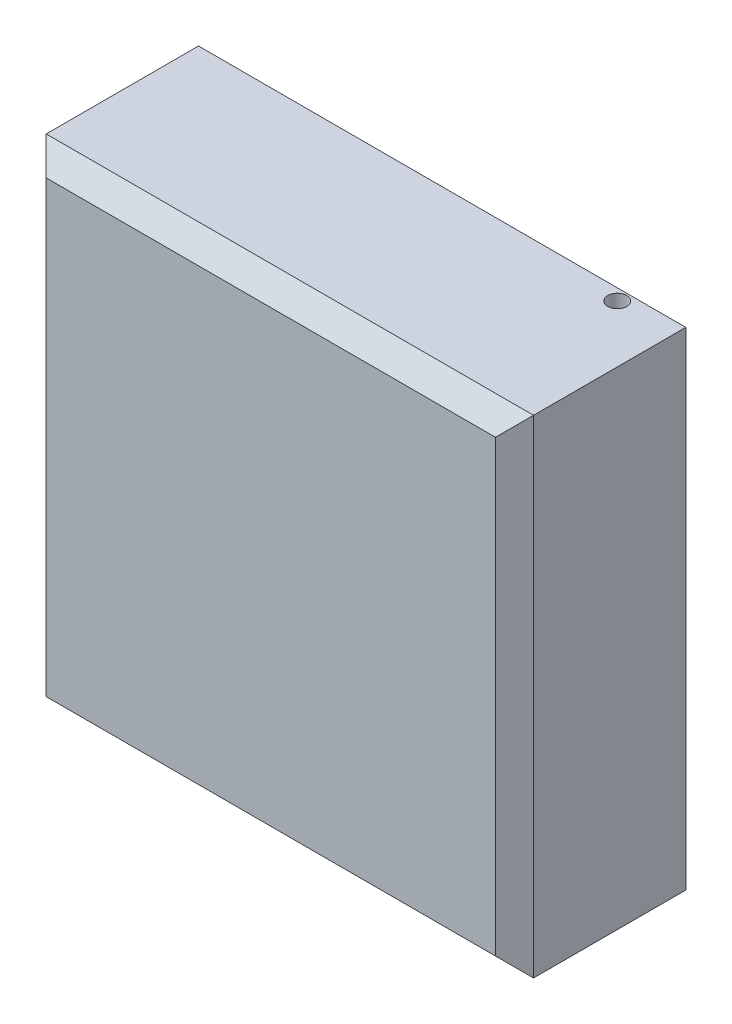
ISO-10303-21;
HEADER;
FILE_DESCRIPTION(('STEP AP214'),'2;1');
FILE_NAME('part.step','',(''),(''),'','','');
FILE_SCHEMA(('AUTOMOTIVE_DESIGN { 1 0 10303 214 1 1 1 1 }'));
ENDSEC;
DATA;
#1=APPLICATION_CONTEXT('core data for automotive mechanical design processes');
#2=APPLICATION_PROTOCOL_DEFINITION('international standard','automotive_design',2000,#1);
#3=PRODUCT_CONTEXT('',#1,'mechanical');
#4=PRODUCT('Part','Part','',(#3));
#5=PRODUCT_RELATED_PRODUCT_CATEGORY('part','',(#4));
#6=PRODUCT_DEFINITION_FORMATION('','',#4);
#7=PRODUCT_DEFINITION_CONTEXT('part definition',#1,'design');
#8=PRODUCT_DEFINITION('design','',#6,#7);
#9=PRODUCT_DEFINITION_SHAPE('','',#8);
#10=(LENGTH_UNIT() NAMED_UNIT(*) SI_UNIT(.MILLI.,.METRE.));
#11=(NAMED_UNIT(*) PLANE_ANGLE_UNIT() SI_UNIT($,.RADIAN.));
#12=(NAMED_UNIT(*) SI_UNIT($,.STERADIAN.) SOLID_ANGLE_UNIT());
#13=UNCERTAINTY_MEASURE_WITH_UNIT(LENGTH_MEASURE(1.E-05),#10,'distance_accuracy_value','');
#14=(GEOMETRIC_REPRESENTATION_CONTEXT(3) GLOBAL_UNCERTAINTY_ASSIGNED_CONTEXT((#13)) GLOBAL_UNIT_ASSIGNED_CONTEXT((#10,
#11,#12)) REPRESENTATION_CONTEXT('',''));
#15=CARTESIAN_POINT('',(0.,0.,0.));
#16=DIRECTION('',(0.,0.,1.));
#17=DIRECTION('',(1.,0.,0.));
#18=AXIS2_PLACEMENT_3D('',#15,#16,#17);
#19=CARTESIAN_POINT('',(128.,128.,100.));
#20=DIRECTION('',(-1.,0.,0.));
#21=DIRECTION('',(0.,-1.,0.));
#22=AXIS2_PLACEMENT_3D('',#19,#20,#21);
#23=PLANE('',#22);
#24=DIRECTION('',(0.,0.,-1.));
#25=VECTOR('',#24,1.);
#26=CARTESIAN_POINT('',(128.,-128.,100.));
#27=LINE('',#26,#25);
#28=CARTESIAN_POINT('',(128.,-128.,90.));
#29=VERTEX_POINT('',#28);
#30=CARTESIAN_POINT('',(128.,-128.,9.99999999999995));
#31=VERTEX_POINT('',#30);
#32=EDGE_CURVE('E179',#29,#31,#27,.T.);
#33=ORIENTED_EDGE('',*,*,#32,.T.);
#34=DIRECTION('',(0.,1.,0.));
#35=VECTOR('',#34,1.);
#36=CARTESIAN_POINT('',(128.,128.,9.99999999999995));
#37=LINE('',#36,#35);
#38=CARTESIAN_POINT('',(128.,128.,9.99999999999995));
#39=VERTEX_POINT('',#38);
#40=EDGE_CURVE('E112',#31,#39,#37,.T.);
#41=ORIENTED_EDGE('',*,*,#40,.T.);
#42=DIRECTION('',(0.,0.,-1.));
#43=VECTOR('',#42,1.);
#44=CARTESIAN_POINT('',(128.,128.,100.));
#45=LINE('',#44,#43);
#46=CARTESIAN_POINT('',(128.,128.,90.));
#47=VERTEX_POINT('',#46);
#48=EDGE_CURVE('E123',#47,#39,#45,.T.);
#49=ORIENTED_EDGE('',*,*,#48,.F.);
#50=DIRECTION('',(0.,-1.,0.));
#51=VECTOR('',#50,1.);
#52=CARTESIAN_POINT('',(128.,-128.,90.));
#53=LINE('',#52,#51);
#54=EDGE_CURVE('E144',#47,#29,#53,.T.);
#55=ORIENTED_EDGE('',*,*,#54,.T.);
#56=EDGE_LOOP('',(#33,#41,#49,#55));
#57=FACE_BOUND('',#56,.T.);
#58=ADVANCED_FACE('F33',(#57),#23,.F.);
#59=CARTESIAN_POINT('',(-128.,128.,100.));
#60=DIRECTION('',(0.,-1.,0.));
#61=DIRECTION('',(0.,0.,-1.));
#62=AXIS2_PLACEMENT_3D('',#59,#60,#61);
#63=PLANE('',#62);
#64=CARTESIAN_POINT('',(98.,128.,16.));
#65=DIRECTION('',(0.,-1.,0.));
#66=DIRECTION('',(0.,0.,-1.));
#67=AXIS2_PLACEMENT_3D('',#64,#65,#66);
#68=CIRCLE('',#67,5.);
#69=CARTESIAN_POINT('',(98.,128.,11.));
#70=VERTEX_POINT('',#69);
#71=EDGE_CURVE('E183',#70,#70,#68,.T.);
#72=ORIENTED_EDGE('',*,*,#71,.T.);
#73=EDGE_LOOP('',(#72));
#74=FACE_BOUND('',#73,.T.);
#75=ORIENTED_EDGE('',*,*,#48,.T.);
#76=DIRECTION('',(-1.,0.,0.));
#77=VECTOR('',#76,1.);
#78=CARTESIAN_POINT('',(-128.,128.,9.99999999999995));
#79=LINE('',#78,#77);
#80=CARTESIAN_POINT('',(-128.,128.,9.99999999999995));
#81=VERTEX_POINT('',#80);
#82=EDGE_CURVE('E122',#39,#81,#79,.T.);
#83=ORIENTED_EDGE('',*,*,#82,.T.);
#84=DIRECTION('',(0.,0.,-1.));
#85=VECTOR('',#84,1.);
#86=CARTESIAN_POINT('',(-128.,128.,100.));
#87=LINE('',#86,#85);
#88=CARTESIAN_POINT('',(-128.,128.,90.));
#89=VERTEX_POINT('',#88);
#90=EDGE_CURVE('E104',#89,#81,#87,.T.);
#91=ORIENTED_EDGE('',*,*,#90,.F.);
#92=DIRECTION('',(1.,0.,0.));
#93=VECTOR('',#92,1.);
#94=CARTESIAN_POINT('',(128.,128.,90.));
#95=LINE('',#94,#93);
#96=EDGE_CURVE('E119',#89,#47,#95,.T.);
#97=ORIENTED_EDGE('',*,*,#96,.T.);
#98=EDGE_LOOP('',(#75,#83,#91,#97));
#99=FACE_BOUND('',#98,.T.);
#100=ADVANCED_FACE('F117',(#74,#99),#63,.F.);
#101=CARTESIAN_POINT('',(-128.,128.,100.));
#102=DIRECTION('',(1.,0.,0.));
#103=DIRECTION('',(0.,1.,0.));
#104=AXIS2_PLACEMENT_3D('',#101,#102,#103);
#105=PLANE('',#104);
#106=ORIENTED_EDGE('',*,*,#90,.T.);
#107=DIRECTION('',(0.,-1.,0.));
#108=VECTOR('',#107,1.);
#109=CARTESIAN_POINT('',(-128.,128.,9.99999999999995));
#110=LINE('',#109,#108);
#111=CARTESIAN_POINT('',(-128.,-128.,9.99999999999995));
#112=VERTEX_POINT('',#111);
#113=EDGE_CURVE('E111',#81,#112,#110,.T.);
#114=ORIENTED_EDGE('',*,*,#113,.T.);
#115=DIRECTION('',(0.,0.,-1.));
#116=VECTOR('',#115,1.);
#117=CARTESIAN_POINT('',(-128.,-128.,100.));
#118=LINE('',#117,#116);
#119=CARTESIAN_POINT('',(-128.,-128.,90.));
#120=VERTEX_POINT('',#119);
#121=EDGE_CURVE('E106',#120,#112,#118,.T.);
#122=ORIENTED_EDGE('',*,*,#121,.F.);
#123=DIRECTION('',(0.,1.,0.));
#124=VECTOR('',#123,1.);
#125=CARTESIAN_POINT('',(-128.,128.,90.));
#126=LINE('',#125,#124);
#127=EDGE_CURVE('E101',#120,#89,#126,.T.);
#128=ORIENTED_EDGE('',*,*,#127,.T.);
#129=EDGE_LOOP('',(#106,#114,#122,#128));
#130=FACE_BOUND('',#129,.T.);
#131=ADVANCED_FACE('F103',(#130),#105,.F.);
#132=CARTESIAN_POINT('',(-128.,-128.,100.));
#133=DIRECTION('',(0.,1.,0.));
#134=DIRECTION('',(0.,0.,1.));
#135=AXIS2_PLACEMENT_3D('',#132,#133,#134);
#136=PLANE('',#135);
#137=CARTESIAN_POINT('',(98.,-128.,16.));
#138=DIRECTION('',(0.,-1.,0.));
#139=DIRECTION('',(0.,0.,-1.));
#140=AXIS2_PLACEMENT_3D('',#137,#138,#139);
#141=CIRCLE('',#140,5.);
#142=CARTESIAN_POINT('',(98.,-128.,11.));
#143=VERTEX_POINT('',#142);
#144=EDGE_CURVE('E167',#143,#143,#141,.T.);
#145=ORIENTED_EDGE('',*,*,#144,.F.);
#146=EDGE_LOOP('',(#145));
#147=FACE_BOUND('',#146,.T.);
#148=ORIENTED_EDGE('',*,*,#121,.T.);
#149=DIRECTION('',(1.,0.,0.));
#150=VECTOR('',#149,1.);
#151=CARTESIAN_POINT('',(-128.,-128.,9.99999999999995));
#152=LINE('',#151,#150);
#153=EDGE_CURVE('E151',#112,#31,#152,.T.);
#154=ORIENTED_EDGE('',*,*,#153,.T.);
#155=ORIENTED_EDGE('',*,*,#32,.F.);
#156=DIRECTION('',(-1.,0.,0.));
#157=VECTOR('',#156,1.);
#158=CARTESIAN_POINT('',(-128.,-128.,90.));
#159=LINE('',#158,#157);
#160=EDGE_CURVE('E149',#29,#120,#159,.T.);
#161=ORIENTED_EDGE('',*,*,#160,.T.);
#162=EDGE_LOOP('',(#148,#154,#155,#161));
#163=FACE_BOUND('',#162,.T.);
#164=ADVANCED_FACE('F181',(#147,#163),#136,.F.);
#165=CARTESIAN_POINT('',(0.,0.,100.));
#166=DIRECTION('',(0.,0.,1.));
#167=DIRECTION('',(1.,0.,0.));
#168=AXIS2_PLACEMENT_3D('',#165,#166,#167);
#169=PLANE('',#168);
#170=DIRECTION('',(1.,0.,0.));
#171=VECTOR('',#170,1.);
#172=CARTESIAN_POINT('',(128.,-118.,100.));
#173=LINE('',#172,#171);
#174=CARTESIAN_POINT('',(-118.,-118.,100.));
#175=VERTEX_POINT('',#174);
#176=CARTESIAN_POINT('',(118.,-118.,100.));
#177=VERTEX_POINT('',#176);
#178=EDGE_CURVE('E153',#175,#177,#173,.T.);
#179=ORIENTED_EDGE('',*,*,#178,.T.);
#180=DIRECTION('',(0.,1.,0.));
#181=VECTOR('',#180,1.);
#182=CARTESIAN_POINT('',(118.,128.,100.));
#183=LINE('',#182,#181);
#184=CARTESIAN_POINT('',(118.,118.,100.));
#185=VERTEX_POINT('',#184);
#186=EDGE_CURVE('E11',#177,#185,#183,.T.);
#187=ORIENTED_EDGE('',*,*,#186,.T.);
#188=DIRECTION('',(-1.,0.,0.));
#189=VECTOR('',#188,1.);
#190=CARTESIAN_POINT('',(-128.,118.,100.));
#191=LINE('',#190,#189);
#192=CARTESIAN_POINT('',(-118.,118.,100.));
#193=VERTEX_POINT('',#192);
#194=EDGE_CURVE('E42',#185,#193,#191,.T.);
#195=ORIENTED_EDGE('',*,*,#194,.T.);
#196=DIRECTION('',(0.,-1.,0.));
#197=VECTOR('',#196,1.);
#198=CARTESIAN_POINT('',(-118.,-128.,100.));
#199=LINE('',#198,#197);
#200=EDGE_CURVE('E127',#193,#175,#199,.T.);
#201=ORIENTED_EDGE('',*,*,#200,.T.);
#202=EDGE_LOOP('',(#179,#187,#195,#201));
#203=FACE_BOUND('',#202,.T.);
#204=ADVANCED_FACE('F195',(#203),#169,.T.);
#205=CARTESIAN_POINT('',(0.,0.,0.));
#206=DIRECTION('',(0.,0.,1.));
#207=DIRECTION('',(1.,0.,0.));
#208=AXIS2_PLACEMENT_3D('',#205,#206,#207);
#209=PLANE('',#208);
#210=DIRECTION('',(0.,1.,0.));
#211=VECTOR('',#210,1.);
#212=CARTESIAN_POINT('',(-118.,0.,0.));
#213=LINE('',#212,#211);
#214=CARTESIAN_POINT('',(-118.,-118.,0.));
#215=VERTEX_POINT('',#214);
#216=CARTESIAN_POINT('',(-118.,118.,0.));
#217=VERTEX_POINT('',#216);
#218=EDGE_CURVE('E137',#215,#217,#213,.T.);
#219=ORIENTED_EDGE('',*,*,#218,.T.);
#220=DIRECTION('',(1.,0.,0.));
#221=VECTOR('',#220,1.);
#222=CARTESIAN_POINT('',(0.,118.,0.));
#223=LINE('',#222,#221);
#224=CARTESIAN_POINT('',(118.,118.,0.));
#225=VERTEX_POINT('',#224);
#226=EDGE_CURVE('E141',#217,#225,#223,.T.);
#227=ORIENTED_EDGE('',*,*,#226,.T.);
#228=DIRECTION('',(0.,-1.,0.));
#229=VECTOR('',#228,1.);
#230=CARTESIAN_POINT('',(118.,0.,0.));
#231=LINE('',#230,#229);
#232=CARTESIAN_POINT('',(118.,-118.,0.));
#233=VERTEX_POINT('',#232);
#234=EDGE_CURVE('E139',#225,#233,#231,.T.);
#235=ORIENTED_EDGE('',*,*,#234,.T.);
#236=DIRECTION('',(-1.,0.,0.));
#237=VECTOR('',#236,1.);
#238=CARTESIAN_POINT('',(0.,-118.,0.));
#239=LINE('',#238,#237);
#240=EDGE_CURVE('E132',#233,#215,#239,.T.);
#241=ORIENTED_EDGE('',*,*,#240,.T.);
#242=EDGE_LOOP('',(#219,#227,#235,#241));
#243=FACE_BOUND('',#242,.T.);
#244=ADVANCED_FACE('F201',(#243),#209,.F.);
#245=CARTESIAN_POINT('',(98.,128.,16.));
#246=DIRECTION('',(0.,-1.,0.));
#247=DIRECTION('',(0.,0.,-1.));
#248=AXIS2_PLACEMENT_3D('',#245,#246,#247);
#249=CYLINDRICAL_SURFACE('',#248,5.);
#250=ORIENTED_EDGE('',*,*,#71,.F.);
#251=EDGE_LOOP('',(#250));
#252=FACE_BOUND('',#251,.T.);
#253=ORIENTED_EDGE('',*,*,#144,.T.);
#254=EDGE_LOOP('',(#253));
#255=FACE_BOUND('',#254,.T.);
#256=ADVANCED_FACE('F192',(#252,#255),#249,.F.);
#257=CARTESIAN_POINT('',(-128.,-128.,9.99999999999995));
#258=DIRECTION('',(0.,0.707106781186548,0.707106781186548));
#259=DIRECTION('',(1.,0.,0.));
#260=AXIS2_PLACEMENT_3D('',#257,#258,#259);
#261=PLANE('',#260);
#262=DIRECTION('',(0.577350269189626,0.577350269189626,-0.577350269189626));
#263=VECTOR('',#262,1.);
#264=CARTESIAN_POINT('',(-128.,-128.,9.99999999999995));
#265=LINE('',#264,#263);
#266=EDGE_CURVE('E161',#215,#112,#265,.F.);
#267=ORIENTED_EDGE('',*,*,#266,.F.);
#268=ORIENTED_EDGE('',*,*,#240,.F.);
#269=DIRECTION('',(0.577350269189626,-0.577350269189626,0.577350269189626));
#270=VECTOR('',#269,1.);
#271=CARTESIAN_POINT('',(42.6666666666667,-42.6666666666666,-75.3333333333334));
#272=LINE('',#271,#270);
#273=EDGE_CURVE('E164',#31,#233,#272,.F.);
#274=ORIENTED_EDGE('',*,*,#273,.F.);
#275=ORIENTED_EDGE('',*,*,#153,.F.);
#276=EDGE_LOOP('',(#267,#268,#274,#275));
#277=FACE_BOUND('',#276,.T.);
#278=ADVANCED_FACE('F224',(#277),#261,.F.);
#279=CARTESIAN_POINT('',(128.,128.,9.99999999999995));
#280=DIRECTION('',(-0.707106781186548,0.,0.707106781186548));
#281=DIRECTION('',(0.,1.,0.));
#282=AXIS2_PLACEMENT_3D('',#279,#280,#281);
#283=PLANE('',#282);
#284=ORIENTED_EDGE('',*,*,#273,.T.);
#285=ORIENTED_EDGE('',*,*,#234,.F.);
#286=DIRECTION('',(0.577350269189626,0.577350269189626,0.577350269189626));
#287=VECTOR('',#286,1.);
#288=CARTESIAN_POINT('',(128.,128.,9.99999999999995));
#289=LINE('',#288,#287);
#290=EDGE_CURVE('E159',#39,#225,#289,.F.);
#291=ORIENTED_EDGE('',*,*,#290,.F.);
#292=ORIENTED_EDGE('',*,*,#40,.F.);
#293=EDGE_LOOP('',(#284,#285,#291,#292));
#294=FACE_BOUND('',#293,.T.);
#295=ADVANCED_FACE('F220',(#294),#283,.F.);
#296=CARTESIAN_POINT('',(-128.,128.,9.99999999999995));
#297=DIRECTION('',(0.707106781186548,0.,0.707106781186548));
#298=DIRECTION('',(0.,-1.,0.));
#299=AXIS2_PLACEMENT_3D('',#296,#297,#298);
#300=PLANE('',#299);
#301=ORIENTED_EDGE('',*,*,#266,.T.);
#302=ORIENTED_EDGE('',*,*,#113,.F.);
#303=DIRECTION('',(0.577350269189626,-0.577350269189626,-0.577350269189626));
#304=VECTOR('',#303,1.);
#305=CARTESIAN_POINT('',(-128.,128.,9.99999999999995));
#306=LINE('',#305,#304);
#307=EDGE_CURVE('E157',#217,#81,#306,.F.);
#308=ORIENTED_EDGE('',*,*,#307,.F.);
#309=ORIENTED_EDGE('',*,*,#218,.F.);
#310=EDGE_LOOP('',(#301,#302,#308,#309));
#311=FACE_BOUND('',#310,.T.);
#312=ADVANCED_FACE('F216',(#311),#300,.F.);
#313=CARTESIAN_POINT('',(-128.,128.,9.99999999999995));
#314=DIRECTION('',(0.,-0.707106781186548,0.707106781186548));
#315=DIRECTION('',(-1.,0.,0.));
#316=AXIS2_PLACEMENT_3D('',#313,#314,#315);
#317=PLANE('',#316);
#318=ORIENTED_EDGE('',*,*,#290,.T.);
#319=ORIENTED_EDGE('',*,*,#226,.F.);
#320=ORIENTED_EDGE('',*,*,#307,.T.);
#321=ORIENTED_EDGE('',*,*,#82,.F.);
#322=EDGE_LOOP('',(#318,#319,#320,#321));
#323=FACE_BOUND('',#322,.T.);
#324=ADVANCED_FACE('F213',(#323),#317,.F.);
#325=CARTESIAN_POINT('',(-118.,0.,100.));
#326=DIRECTION('',(-0.707106781186549,0.,0.707106781186546));
#327=DIRECTION('',(0.,1.,0.));
#328=AXIS2_PLACEMENT_3D('',#325,#326,#327);
#329=PLANE('',#328);
#330=DIRECTION('',(-0.577350269189625,0.577350269189625,-0.577350269189628));
#331=VECTOR('',#330,1.);
#332=CARTESIAN_POINT('',(-78.6666666666669,78.6666666666668,139.333333333333));
#333=LINE('',#332,#331);
#334=EDGE_CURVE('E126',#89,#193,#333,.F.);
#335=ORIENTED_EDGE('',*,*,#334,.F.);
#336=ORIENTED_EDGE('',*,*,#127,.F.);
#337=DIRECTION('',(-0.577350269189625,-0.577350269189625,-0.577350269189628));
#338=VECTOR('',#337,1.);
#339=CARTESIAN_POINT('',(-78.6666666666669,-78.6666666666668,139.333333333333));
#340=LINE('',#339,#338);
#341=EDGE_CURVE('E37',#175,#120,#340,.T.);
#342=ORIENTED_EDGE('',*,*,#341,.F.);
#343=ORIENTED_EDGE('',*,*,#200,.F.);
#344=EDGE_LOOP('',(#335,#336,#342,#343));
#345=FACE_BOUND('',#344,.T.);
#346=ADVANCED_FACE('F35',(#345),#329,.T.);
#347=CARTESIAN_POINT('',(0.,-118.,100.));
#348=DIRECTION('',(0.,-0.707106781186549,0.707106781186546));
#349=DIRECTION('',(-1.,0.,0.));
#350=AXIS2_PLACEMENT_3D('',#347,#348,#349);
#351=PLANE('',#350);
#352=ORIENTED_EDGE('',*,*,#341,.T.);
#353=ORIENTED_EDGE('',*,*,#160,.F.);
#354=DIRECTION('',(-0.577350269189625,0.577350269189625,0.577350269189628));
#355=VECTOR('',#354,1.);
#356=CARTESIAN_POINT('',(78.6666666666668,-78.6666666666668,139.333333333333));
#357=LINE('',#356,#355);
#358=EDGE_CURVE('E129',#177,#29,#357,.F.);
#359=ORIENTED_EDGE('',*,*,#358,.F.);
#360=ORIENTED_EDGE('',*,*,#178,.F.);
#361=EDGE_LOOP('',(#352,#353,#359,#360));
#362=FACE_BOUND('',#361,.T.);
#363=ADVANCED_FACE('F174',(#362),#351,.T.);
#364=CARTESIAN_POINT('',(0.,118.,100.));
#365=DIRECTION('',(0.,0.707106781186549,0.707106781186546));
#366=DIRECTION('',(1.,0.,0.));
#367=AXIS2_PLACEMENT_3D('',#364,#365,#366);
#368=PLANE('',#367);
#369=ORIENTED_EDGE('',*,*,#334,.T.);
#370=ORIENTED_EDGE('',*,*,#194,.F.);
#371=DIRECTION('',(0.577350269189625,0.577350269189625,-0.577350269189628));
#372=VECTOR('',#371,1.);
#373=CARTESIAN_POINT('',(78.6666666666669,78.6666666666669,139.333333333333));
#374=LINE('',#373,#372);
#375=EDGE_CURVE('E50',#47,#185,#374,.F.);
#376=ORIENTED_EDGE('',*,*,#375,.F.);
#377=ORIENTED_EDGE('',*,*,#96,.F.);
#378=EDGE_LOOP('',(#369,#370,#376,#377));
#379=FACE_BOUND('',#378,.T.);
#380=ADVANCED_FACE('F130',(#379),#368,.T.);
#381=CARTESIAN_POINT('',(118.,0.,100.));
#382=DIRECTION('',(0.707106781186549,0.,0.707106781186546));
#383=DIRECTION('',(0.,-1.,0.));
#384=AXIS2_PLACEMENT_3D('',#381,#382,#383);
#385=PLANE('',#384);
#386=ORIENTED_EDGE('',*,*,#358,.T.);
#387=ORIENTED_EDGE('',*,*,#54,.F.);
#388=ORIENTED_EDGE('',*,*,#375,.T.);
#389=ORIENTED_EDGE('',*,*,#186,.F.);
#390=EDGE_LOOP('',(#386,#387,#388,#389));
#391=FACE_BOUND('',#390,.T.);
#392=ADVANCED_FACE('F171',(#391),#385,.T.);
#393=CLOSED_SHELL('',(#58,#100,#131,#164,#204,#244,#256,#278,#295,#312,#324,#346,#363,#380,#392));
#394=MANIFOLD_SOLID_BREP('B2',#393);
#395=ADVANCED_BREP_SHAPE_REPRESENTATION('',(#18,#394),#14);
#396=SHAPE_DEFINITION_REPRESENTATION(#9,#395);
ENDSEC;
END-ISO-10303-21;
